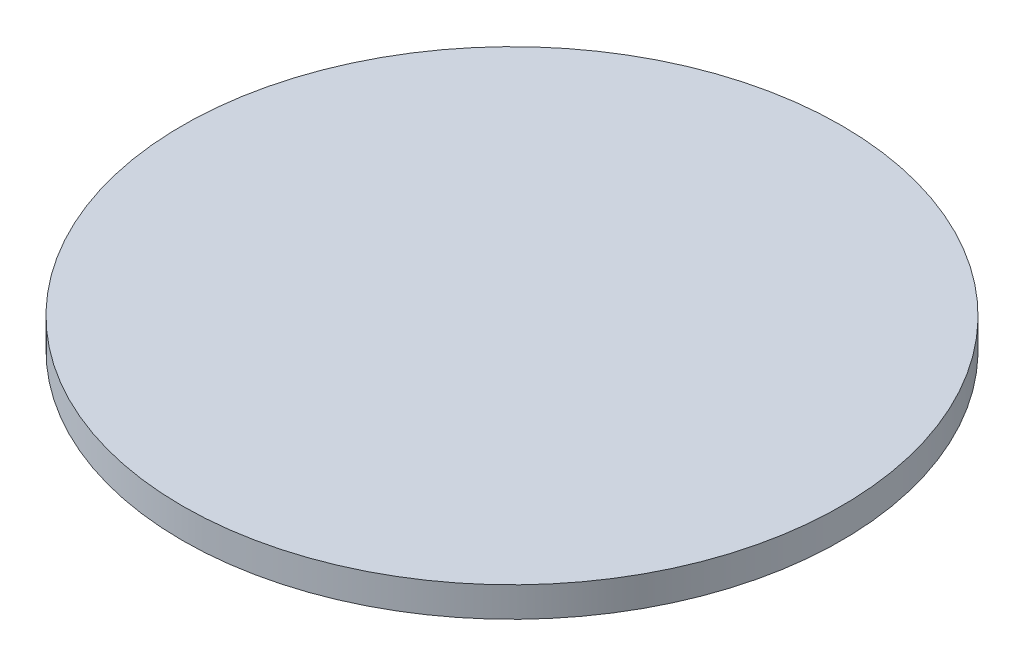
ISO-10303-21;
HEADER;
FILE_DESCRIPTION(('STEP AP214'),'2;1');
FILE_NAME('part.step','',(''),(''),'','','');
FILE_SCHEMA(('AUTOMOTIVE_DESIGN { 1 0 10303 214 1 1 1 1 }'));
ENDSEC;
DATA;
#1=APPLICATION_CONTEXT('core data for automotive mechanical design processes');
#2=APPLICATION_PROTOCOL_DEFINITION('international standard','automotive_design',2000,#1);
#3=PRODUCT_CONTEXT('',#1,'mechanical');
#4=PRODUCT('Part','Part','',(#3));
#5=PRODUCT_RELATED_PRODUCT_CATEGORY('part','',(#4));
#6=PRODUCT_DEFINITION_FORMATION('','',#4);
#7=PRODUCT_DEFINITION_CONTEXT('part definition',#1,'design');
#8=PRODUCT_DEFINITION('design','',#6,#7);
#9=PRODUCT_DEFINITION_SHAPE('','',#8);
#10=(LENGTH_UNIT() NAMED_UNIT(*) SI_UNIT(.MILLI.,.METRE.));
#11=(NAMED_UNIT(*) PLANE_ANGLE_UNIT() SI_UNIT($,.RADIAN.));
#12=(NAMED_UNIT(*) SI_UNIT($,.STERADIAN.) SOLID_ANGLE_UNIT());
#13=UNCERTAINTY_MEASURE_WITH_UNIT(LENGTH_MEASURE(1.E-05),#10,'distance_accuracy_value','');
#14=(GEOMETRIC_REPRESENTATION_CONTEXT(3) GLOBAL_UNCERTAINTY_ASSIGNED_CONTEXT((#13)) GLOBAL_UNIT_ASSIGNED_CONTEXT((#10,
#11,#12)) REPRESENTATION_CONTEXT('',''));
#15=CARTESIAN_POINT('',(0.,0.,0.));
#16=DIRECTION('',(0.,0.,1.));
#17=DIRECTION('',(1.,0.,0.));
#18=AXIS2_PLACEMENT_3D('',#15,#16,#17);
#19=CARTESIAN_POINT('',(0.,3.175,0.));
#20=DIRECTION('',(0.,-1.,0.));
#21=DIRECTION('',(0.,0.,-1.));
#22=AXIS2_PLACEMENT_3D('',#19,#20,#21);
#23=CYLINDRICAL_SURFACE('',#22,35.);
#24=CARTESIAN_POINT('',(0.,3.175,0.));
#25=DIRECTION('',(0.,1.,0.));
#26=DIRECTION('',(0.,0.,1.));
#27=AXIS2_PLACEMENT_3D('',#24,#25,#26);
#28=CIRCLE('',#27,35.);
#29=CARTESIAN_POINT('',(0.,3.175,35.));
#30=VERTEX_POINT('',#29);
#31=EDGE_CURVE('E10',#30,#30,#28,.T.);
#32=ORIENTED_EDGE('',*,*,#31,.F.);
#33=EDGE_LOOP('',(#32));
#34=FACE_BOUND('',#33,.T.);
#35=CARTESIAN_POINT('',(0.,0.,0.));
#36=DIRECTION('',(0.,1.,0.));
#37=DIRECTION('',(0.,0.,1.));
#38=AXIS2_PLACEMENT_3D('',#35,#36,#37);
#39=CIRCLE('',#38,35.);
#40=CARTESIAN_POINT('',(0.,0.,35.));
#41=VERTEX_POINT('',#40);
#42=EDGE_CURVE('E34',#41,#41,#39,.T.);
#43=ORIENTED_EDGE('',*,*,#42,.T.);
#44=EDGE_LOOP('',(#43));
#45=FACE_BOUND('',#44,.T.);
#46=ADVANCED_FACE('F31',(#34,#45),#23,.T.);
#47=CARTESIAN_POINT('',(0.,3.175,0.));
#48=DIRECTION('',(0.,1.,0.));
#49=DIRECTION('',(0.,0.,1.));
#50=AXIS2_PLACEMENT_3D('',#47,#48,#49);
#51=PLANE('',#50);
#52=ORIENTED_EDGE('',*,*,#31,.T.);
#53=EDGE_LOOP('',(#52));
#54=FACE_BOUND('',#53,.T.);
#55=ADVANCED_FACE('F46',(#54),#51,.T.);
#56=CARTESIAN_POINT('',(0.,0.,0.));
#57=DIRECTION('',(0.,1.,0.));
#58=DIRECTION('',(0.,0.,1.));
#59=AXIS2_PLACEMENT_3D('',#56,#57,#58);
#60=PLANE('',#59);
#61=ORIENTED_EDGE('',*,*,#42,.F.);
#62=EDGE_LOOP('',(#61));
#63=FACE_BOUND('',#62,.T.);
#64=ADVANCED_FACE('F44',(#63),#60,.F.);
#65=CLOSED_SHELL('',(#46,#55,#64));
#66=MANIFOLD_SOLID_BREP('B2',#65);
#67=ADVANCED_BREP_SHAPE_REPRESENTATION('',(#18,#66),#14);
#68=SHAPE_DEFINITION_REPRESENTATION(#9,#67);
ENDSEC;
END-ISO-10303-21;
